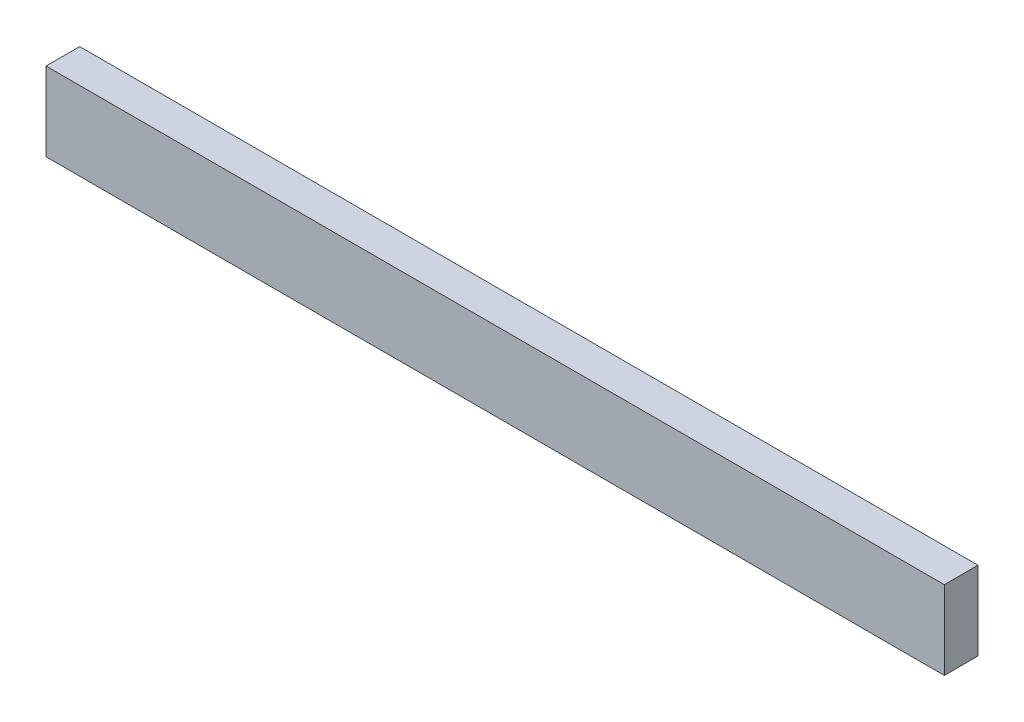
ISO-10303-21;
HEADER;
FILE_DESCRIPTION(('STEP AP214'),'2;1');
FILE_NAME('part.step','',(''),(''),'','','');
FILE_SCHEMA(('AUTOMOTIVE_DESIGN { 1 0 10303 214 1 1 1 1 }'));
ENDSEC;
DATA;
#1=APPLICATION_CONTEXT('core data for automotive mechanical design processes');
#2=APPLICATION_PROTOCOL_DEFINITION('international standard','automotive_design',2000,#1);
#3=PRODUCT_CONTEXT('',#1,'mechanical');
#4=PRODUCT('Part','Part','',(#3));
#5=PRODUCT_RELATED_PRODUCT_CATEGORY('part','',(#4));
#6=PRODUCT_DEFINITION_FORMATION('','',#4);
#7=PRODUCT_DEFINITION_CONTEXT('part definition',#1,'design');
#8=PRODUCT_DEFINITION('design','',#6,#7);
#9=PRODUCT_DEFINITION_SHAPE('','',#8);
#10=(LENGTH_UNIT() NAMED_UNIT(*) SI_UNIT(.MILLI.,.METRE.));
#11=(NAMED_UNIT(*) PLANE_ANGLE_UNIT() SI_UNIT($,.RADIAN.));
#12=(NAMED_UNIT(*) SI_UNIT($,.STERADIAN.) SOLID_ANGLE_UNIT());
#13=UNCERTAINTY_MEASURE_WITH_UNIT(LENGTH_MEASURE(1.E-05),#10,'distance_accuracy_value','');
#14=(GEOMETRIC_REPRESENTATION_CONTEXT(3) GLOBAL_UNCERTAINTY_ASSIGNED_CONTEXT((#13)) GLOBAL_UNIT_ASSIGNED_CONTEXT((#10,
#11,#12)) REPRESENTATION_CONTEXT('',''));
#15=CARTESIAN_POINT('',(0.,0.,0.));
#16=DIRECTION('',(0.,0.,1.));
#17=DIRECTION('',(1.,0.,0.));
#18=AXIS2_PLACEMENT_3D('',#15,#16,#17);
#19=CARTESIAN_POINT('',(-508.,-88.9,173.0375));
#20=DIRECTION('',(1.,0.,0.));
#21=DIRECTION('',(0.,0.,-1.));
#22=AXIS2_PLACEMENT_3D('',#19,#20,#21);
#23=PLANE('',#22);
#24=DIRECTION('',(0.,0.,-1.));
#25=VECTOR('',#24,1.);
#26=CARTESIAN_POINT('',(-508.,0.,173.0375));
#27=LINE('',#26,#25);
#28=CARTESIAN_POINT('',(-508.,0.,173.0375));
#29=VERTEX_POINT('',#28);
#30=CARTESIAN_POINT('',(-508.,0.,134.9375));
#31=VERTEX_POINT('',#30);
#32=EDGE_CURVE('E99',#29,#31,#27,.T.);
#33=ORIENTED_EDGE('',*,*,#32,.T.);
#34=DIRECTION('',(0.,1.,0.));
#35=VECTOR('',#34,1.);
#36=CARTESIAN_POINT('',(-508.,-88.9,134.9375));
#37=LINE('',#36,#35);
#38=CARTESIAN_POINT('',(-508.,-88.9,134.9375));
#39=VERTEX_POINT('',#38);
#40=EDGE_CURVE('E11',#39,#31,#37,.T.);
#41=ORIENTED_EDGE('',*,*,#40,.F.);
#42=DIRECTION('',(0.,0.,-1.));
#43=VECTOR('',#42,1.);
#44=CARTESIAN_POINT('',(-508.,-88.9,173.0375));
#45=LINE('',#44,#43);
#46=CARTESIAN_POINT('',(-508.,-88.9,173.0375));
#47=VERTEX_POINT('',#46);
#48=EDGE_CURVE('E87',#47,#39,#45,.T.);
#49=ORIENTED_EDGE('',*,*,#48,.F.);
#50=DIRECTION('',(0.,1.,0.));
#51=VECTOR('',#50,1.);
#52=CARTESIAN_POINT('',(-508.,-88.9,173.0375));
#53=LINE('',#52,#51);
#54=EDGE_CURVE('E95',#47,#29,#53,.T.);
#55=ORIENTED_EDGE('',*,*,#54,.T.);
#56=EDGE_LOOP('',(#33,#41,#49,#55));
#57=FACE_BOUND('',#56,.T.);
#58=ADVANCED_FACE('F36',(#57),#23,.F.);
#59=CARTESIAN_POINT('',(-508.,-88.9,134.9375));
#60=DIRECTION('',(0.,0.,1.));
#61=DIRECTION('',(1.,0.,0.));
#62=AXIS2_PLACEMENT_3D('',#59,#60,#61);
#63=PLANE('',#62);
#64=DIRECTION('',(1.,0.,0.));
#65=VECTOR('',#64,1.);
#66=CARTESIAN_POINT('',(-508.,0.,134.9375));
#67=LINE('',#66,#65);
#68=CARTESIAN_POINT('',(508.,0.,134.9375));
#69=VERTEX_POINT('',#68);
#70=EDGE_CURVE('E91',#31,#69,#67,.T.);
#71=ORIENTED_EDGE('',*,*,#70,.T.);
#72=DIRECTION('',(0.,1.,0.));
#73=VECTOR('',#72,1.);
#74=CARTESIAN_POINT('',(508.,-88.9,134.9375));
#75=LINE('',#74,#73);
#76=CARTESIAN_POINT('',(508.,-88.9,134.9375));
#77=VERTEX_POINT('',#76);
#78=EDGE_CURVE('E44',#77,#69,#75,.T.);
#79=ORIENTED_EDGE('',*,*,#78,.F.);
#80=DIRECTION('',(1.,0.,0.));
#81=VECTOR('',#80,1.);
#82=CARTESIAN_POINT('',(-508.,-88.9,134.9375));
#83=LINE('',#82,#81);
#84=EDGE_CURVE('E82',#39,#77,#83,.T.);
#85=ORIENTED_EDGE('',*,*,#84,.F.);
#86=ORIENTED_EDGE('',*,*,#40,.T.);
#87=EDGE_LOOP('',(#71,#79,#85,#86));
#88=FACE_BOUND('',#87,.T.);
#89=ADVANCED_FACE('F90',(#88),#63,.F.);
#90=CARTESIAN_POINT('',(508.,-88.9,173.0375));
#91=DIRECTION('',(-1.,0.,0.));
#92=DIRECTION('',(0.,0.,1.));
#93=AXIS2_PLACEMENT_3D('',#90,#91,#92);
#94=PLANE('',#93);
#95=DIRECTION('',(0.,0.,1.));
#96=VECTOR('',#95,1.);
#97=CARTESIAN_POINT('',(508.,0.,173.0375));
#98=LINE('',#97,#96);
#99=CARTESIAN_POINT('',(508.,0.,173.0375));
#100=VERTEX_POINT('',#99);
#101=EDGE_CURVE('E69',#69,#100,#98,.T.);
#102=ORIENTED_EDGE('',*,*,#101,.T.);
#103=DIRECTION('',(0.,1.,0.));
#104=VECTOR('',#103,1.);
#105=CARTESIAN_POINT('',(508.,-88.9,173.0375));
#106=LINE('',#105,#104);
#107=CARTESIAN_POINT('',(508.,-88.9,173.0375));
#108=VERTEX_POINT('',#107);
#109=EDGE_CURVE('E92',#108,#100,#106,.T.);
#110=ORIENTED_EDGE('',*,*,#109,.F.);
#111=DIRECTION('',(0.,0.,1.));
#112=VECTOR('',#111,1.);
#113=CARTESIAN_POINT('',(508.,-88.9,173.0375));
#114=LINE('',#113,#112);
#115=EDGE_CURVE('E85',#77,#108,#114,.T.);
#116=ORIENTED_EDGE('',*,*,#115,.F.);
#117=ORIENTED_EDGE('',*,*,#78,.T.);
#118=EDGE_LOOP('',(#102,#110,#116,#117));
#119=FACE_BOUND('',#118,.T.);
#120=ADVANCED_FACE('F93',(#119),#94,.F.);
#121=CARTESIAN_POINT('',(-508.,-88.9,173.0375));
#122=DIRECTION('',(0.,0.,-1.));
#123=DIRECTION('',(-1.,0.,0.));
#124=AXIS2_PLACEMENT_3D('',#121,#122,#123);
#125=PLANE('',#124);
#126=DIRECTION('',(-1.,0.,0.));
#127=VECTOR('',#126,1.);
#128=CARTESIAN_POINT('',(-508.,0.,173.0375));
#129=LINE('',#128,#127);
#130=EDGE_CURVE('E75',#100,#29,#129,.T.);
#131=ORIENTED_EDGE('',*,*,#130,.T.);
#132=ORIENTED_EDGE('',*,*,#54,.F.);
#133=DIRECTION('',(-1.,0.,0.));
#134=VECTOR('',#133,1.);
#135=CARTESIAN_POINT('',(-508.,-88.9,173.0375));
#136=LINE('',#135,#134);
#137=EDGE_CURVE('E52',#108,#47,#136,.T.);
#138=ORIENTED_EDGE('',*,*,#137,.F.);
#139=ORIENTED_EDGE('',*,*,#109,.T.);
#140=EDGE_LOOP('',(#131,#132,#138,#139));
#141=FACE_BOUND('',#140,.T.);
#142=ADVANCED_FACE('F106',(#141),#125,.F.);
#143=CARTESIAN_POINT('',(0.,-88.9,0.));
#144=DIRECTION('',(0.,-1.,0.));
#145=DIRECTION('',(0.,0.,-1.));
#146=AXIS2_PLACEMENT_3D('',#143,#144,#145);
#147=PLANE('',#146);
#148=ORIENTED_EDGE('',*,*,#48,.T.);
#149=ORIENTED_EDGE('',*,*,#84,.T.);
#150=ORIENTED_EDGE('',*,*,#115,.T.);
#151=ORIENTED_EDGE('',*,*,#137,.T.);
#152=EDGE_LOOP('',(#148,#149,#150,#151));
#153=FACE_BOUND('',#152,.T.);
#154=ADVANCED_FACE('F83',(#153),#147,.T.);
#155=CARTESIAN_POINT('',(0.,0.,0.));
#156=DIRECTION('',(0.,-1.,0.));
#157=DIRECTION('',(0.,0.,-1.));
#158=AXIS2_PLACEMENT_3D('',#155,#156,#157);
#159=PLANE('',#158);
#160=ORIENTED_EDGE('',*,*,#32,.F.);
#161=ORIENTED_EDGE('',*,*,#130,.F.);
#162=ORIENTED_EDGE('',*,*,#101,.F.);
#163=ORIENTED_EDGE('',*,*,#70,.F.);
#164=EDGE_LOOP('',(#160,#161,#162,#163));
#165=FACE_BOUND('',#164,.T.);
#166=ADVANCED_FACE('F109',(#165),#159,.F.);
#167=CLOSED_SHELL('',(#58,#89,#120,#142,#154,#166));
#168=MANIFOLD_SOLID_BREP('B2',#167);
#169=ADVANCED_BREP_SHAPE_REPRESENTATION('',(#18,#168),#14);
#170=SHAPE_DEFINITION_REPRESENTATION(#9,#169);
ENDSEC;
END-ISO-10303-21;
